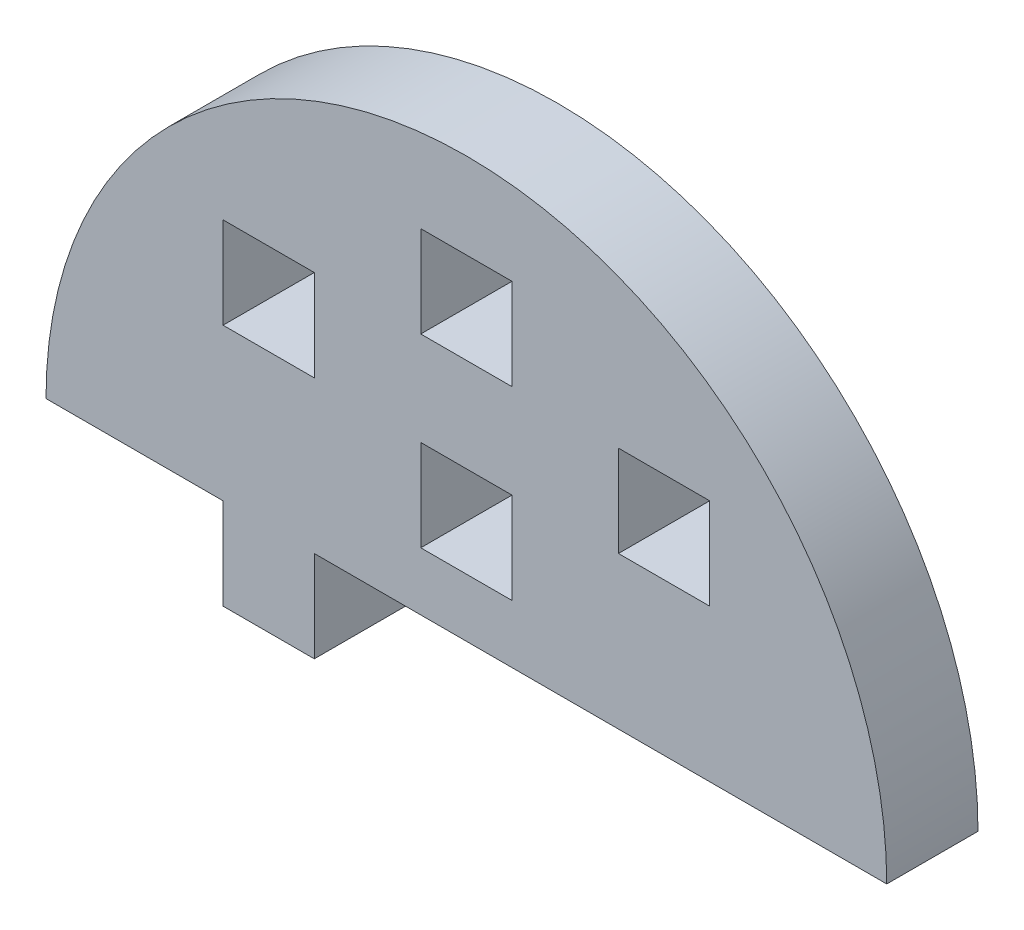
ISO-10303-21;
HEADER;
FILE_DESCRIPTION(('STEP AP214'),'2;1');
FILE_NAME('part.step','',(''),(''),'','','');
FILE_SCHEMA(('AUTOMOTIVE_DESIGN { 1 0 10303 214 1 1 1 1 }'));
ENDSEC;
DATA;
#1=APPLICATION_CONTEXT('core data for automotive mechanical design processes');
#2=APPLICATION_PROTOCOL_DEFINITION('international standard','automotive_design',2000,#1);
#3=PRODUCT_CONTEXT('',#1,'mechanical');
#4=PRODUCT('Part','Part','',(#3));
#5=PRODUCT_RELATED_PRODUCT_CATEGORY('part','',(#4));
#6=PRODUCT_DEFINITION_FORMATION('','',#4);
#7=PRODUCT_DEFINITION_CONTEXT('part definition',#1,'design');
#8=PRODUCT_DEFINITION('design','',#6,#7);
#9=PRODUCT_DEFINITION_SHAPE('','',#8);
#10=(LENGTH_UNIT() NAMED_UNIT(*) SI_UNIT(.MILLI.,.METRE.));
#11=(NAMED_UNIT(*) PLANE_ANGLE_UNIT() SI_UNIT($,.RADIAN.));
#12=(NAMED_UNIT(*) SI_UNIT($,.STERADIAN.) SOLID_ANGLE_UNIT());
#13=UNCERTAINTY_MEASURE_WITH_UNIT(LENGTH_MEASURE(1.E-05),#10,'distance_accuracy_value','');
#14=(GEOMETRIC_REPRESENTATION_CONTEXT(3) GLOBAL_UNCERTAINTY_ASSIGNED_CONTEXT((#13)) GLOBAL_UNIT_ASSIGNED_CONTEXT((#10,
#11,#12)) REPRESENTATION_CONTEXT('',''));
#15=CARTESIAN_POINT('',(0.,0.,0.));
#16=DIRECTION('',(0.,0.,1.));
#17=DIRECTION('',(1.,0.,0.));
#18=AXIS2_PLACEMENT_3D('',#15,#16,#17);
#19=CARTESIAN_POINT('',(3501.84727569733,1193.0171466111,6.));
#20=DIRECTION('',(0.,0.,1.));
#21=DIRECTION('',(1.,0.,0.));
#22=AXIS2_PLACEMENT_3D('',#19,#20,#21);
#23=PLANE('',#22);
#24=DIRECTION('',(0.,1.,0.));
#25=VECTOR('',#24,1.);
#26=CARTESIAN_POINT('',(3511.84727569733,0.,6.));
#27=LINE('',#26,#25);
#28=CARTESIAN_POINT('',(3511.84727569733,1203.0171466111,6.));
#29=VERTEX_POINT('',#28);
#30=CARTESIAN_POINT('',(3511.84727569733,1209.0171466111,6.));
#31=VERTEX_POINT('',#30);
#32=EDGE_CURVE('E321',#29,#31,#27,.T.);
#33=ORIENTED_EDGE('',*,*,#32,.T.);
#34=DIRECTION('',(1.,0.,0.));
#35=VECTOR('',#34,1.);
#36=CARTESIAN_POINT('',(0.,1209.0171466111,6.));
#37=LINE('',#36,#35);
#38=CARTESIAN_POINT('',(3517.84727569733,1209.0171466111,6.));
#39=VERTEX_POINT('',#38);
#40=EDGE_CURVE('E334',#31,#39,#37,.T.);
#41=ORIENTED_EDGE('',*,*,#40,.T.);
#42=DIRECTION('',(0.,-1.,0.));
#43=VECTOR('',#42,1.);
#44=CARTESIAN_POINT('',(3517.84727569733,0.,6.));
#45=LINE('',#44,#43);
#46=CARTESIAN_POINT('',(3517.84727569733,1203.0171466111,6.));
#47=VERTEX_POINT('',#46);
#48=EDGE_CURVE('E175',#39,#47,#45,.T.);
#49=ORIENTED_EDGE('',*,*,#48,.T.);
#50=DIRECTION('',(-1.,0.,0.));
#51=VECTOR('',#50,1.);
#52=CARTESIAN_POINT('',(0.,1203.0171466111,6.));
#53=LINE('',#52,#51);
#54=EDGE_CURVE('E313',#47,#29,#53,.T.);
#55=ORIENTED_EDGE('',*,*,#54,.T.);
#56=EDGE_LOOP('',(#33,#41,#49,#55));
#57=FACE_BOUND('',#56,.T.);
#58=DIRECTION('',(0.,1.,0.));
#59=VECTOR('',#58,1.);
#60=CARTESIAN_POINT('',(3498.84727569733,0.,6.));
#61=LINE('',#60,#59);
#62=CARTESIAN_POINT('',(3498.84727569733,1209.0171466111,6.));
#63=VERTEX_POINT('',#62);
#64=CARTESIAN_POINT('',(3498.84727569733,1215.0171466111,6.));
#65=VERTEX_POINT('',#64);
#66=EDGE_CURVE('E400',#63,#65,#61,.T.);
#67=ORIENTED_EDGE('',*,*,#66,.T.);
#68=DIRECTION('',(1.,0.,0.));
#69=VECTOR('',#68,1.);
#70=CARTESIAN_POINT('',(0.,1215.0171466111,6.));
#71=LINE('',#70,#69);
#72=CARTESIAN_POINT('',(3504.84727569733,1215.0171466111,6.));
#73=VERTEX_POINT('',#72);
#74=EDGE_CURVE('E413',#65,#73,#71,.T.);
#75=ORIENTED_EDGE('',*,*,#74,.T.);
#76=DIRECTION('',(0.,-1.,0.));
#77=VECTOR('',#76,1.);
#78=CARTESIAN_POINT('',(3504.84727569733,0.,6.));
#79=LINE('',#78,#77);
#80=CARTESIAN_POINT('',(3504.84727569733,1209.0171466111,6.));
#81=VERTEX_POINT('',#80);
#82=EDGE_CURVE('E409',#73,#81,#79,.T.);
#83=ORIENTED_EDGE('',*,*,#82,.T.);
#84=DIRECTION('',(-1.,0.,0.));
#85=VECTOR('',#84,1.);
#86=CARTESIAN_POINT('',(0.,1209.0171466111,6.));
#87=LINE('',#86,#85);
#88=EDGE_CURVE('E404',#81,#63,#87,.T.);
#89=ORIENTED_EDGE('',*,*,#88,.T.);
#90=EDGE_LOOP('',(#67,#75,#83,#89));
#91=FACE_BOUND('',#90,.T.);
#92=DIRECTION('',(1.,6.72453869943398E-13,0.));
#93=VECTOR('',#92,1.);
#94=CARTESIAN_POINT('',(3491.84727569733,1193.0171466111,6.));
#95=LINE('',#94,#93);
#96=CARTESIAN_POINT('',(3491.84727569733,1193.0171466111,6.));
#97=VERTEX_POINT('',#96);
#98=CARTESIAN_POINT('',(3529.49013284021,1193.01714661112,6.));
#99=VERTEX_POINT('',#98);
#100=EDGE_CURVE('E487',#97,#99,#95,.T.);
#101=ORIENTED_EDGE('',*,*,#100,.T.);
#102=CARTESIAN_POINT('',(3501.84727569733,1193.0171466111,6.));
#103=DIRECTION('',(0.,0.,1.));
#104=DIRECTION('',(1.,0.,0.));
#105=AXIS2_PLACEMENT_3D('',#102,#103,#104);
#106=CIRCLE('',#105,27.642857142876);
#107=CARTESIAN_POINT('',(3474.20441855446,1193.01714661112,6.));
#108=VERTEX_POINT('',#107);
#109=EDGE_CURVE('E491',#99,#108,#106,.T.);
#110=ORIENTED_EDGE('',*,*,#109,.T.);
#111=DIRECTION('',(1.,-2.17412999668575E-12,0.));
#112=VECTOR('',#111,1.);
#113=CARTESIAN_POINT('',(3474.20441855446,1193.01714661112,6.));
#114=LINE('',#113,#112);
#115=CARTESIAN_POINT('',(3485.84727569733,1193.0171466111,6.));
#116=VERTEX_POINT('',#115);
#117=EDGE_CURVE('E495',#108,#116,#114,.T.);
#118=ORIENTED_EDGE('',*,*,#117,.T.);
#119=DIRECTION('',(0.,1.,0.));
#120=VECTOR('',#119,1.);
#121=CARTESIAN_POINT('',(3485.84727569733,1187.0171466111,6.));
#122=LINE('',#121,#120);
#123=CARTESIAN_POINT('',(3485.84727569733,1187.0171466111,6.));
#124=VERTEX_POINT('',#123);
#125=EDGE_CURVE('E498',#124,#116,#122,.T.);
#126=ORIENTED_EDGE('',*,*,#125,.F.);
#127=DIRECTION('',(-1.,0.,0.));
#128=VECTOR('',#127,1.);
#129=CARTESIAN_POINT('',(3491.84727569733,1187.0171466111,6.));
#130=LINE('',#129,#128);
#131=CARTESIAN_POINT('',(3491.84727569733,1187.0171466111,6.));
#132=VERTEX_POINT('',#131);
#133=EDGE_CURVE('E502',#132,#124,#130,.T.);
#134=ORIENTED_EDGE('',*,*,#133,.F.);
#135=DIRECTION('',(0.,-1.,0.));
#136=VECTOR('',#135,1.);
#137=CARTESIAN_POINT('',(3491.84727569733,1193.0171466111,6.));
#138=LINE('',#137,#136);
#139=EDGE_CURVE('E506',#97,#132,#138,.T.);
#140=ORIENTED_EDGE('',*,*,#139,.F.);
#141=EDGE_LOOP('',(#101,#110,#118,#126,#134,#140));
#142=FACE_BOUND('',#141,.T.);
#143=DIRECTION('',(0.,1.,0.));
#144=VECTOR('',#143,1.);
#145=CARTESIAN_POINT('',(3491.84727569733,0.,6.));
#146=LINE('',#145,#144);
#147=CARTESIAN_POINT('',(3491.84727569733,1203.0171466111,6.));
#148=VERTEX_POINT('',#147);
#149=CARTESIAN_POINT('',(3491.84727569733,1209.0171466111,6.));
#150=VERTEX_POINT('',#149);
#151=EDGE_CURVE('E447',#148,#150,#146,.T.);
#152=ORIENTED_EDGE('',*,*,#151,.F.);
#153=DIRECTION('',(1.,0.,0.));
#154=VECTOR('',#153,1.);
#155=CARTESIAN_POINT('',(0.,1203.0171466111,6.));
#156=LINE('',#155,#154);
#157=CARTESIAN_POINT('',(3485.84727569733,1203.0171466111,6.));
#158=VERTEX_POINT('',#157);
#159=EDGE_CURVE('E444',#158,#148,#156,.T.);
#160=ORIENTED_EDGE('',*,*,#159,.F.);
#161=DIRECTION('',(0.,-1.,0.));
#162=VECTOR('',#161,1.);
#163=CARTESIAN_POINT('',(3485.84727569733,0.,6.));
#164=LINE('',#163,#162);
#165=CARTESIAN_POINT('',(3485.84727569733,1209.0171466111,6.));
#166=VERTEX_POINT('',#165);
#167=EDGE_CURVE('E455',#166,#158,#164,.T.);
#168=ORIENTED_EDGE('',*,*,#167,.F.);
#169=DIRECTION('',(-1.,0.,0.));
#170=VECTOR('',#169,1.);
#171=CARTESIAN_POINT('',(0.,1209.0171466111,6.));
#172=LINE('',#171,#170);
#173=EDGE_CURVE('E451',#150,#166,#172,.T.);
#174=ORIENTED_EDGE('',*,*,#173,.F.);
#175=EDGE_LOOP('',(#152,#160,#168,#174));
#176=FACE_BOUND('',#175,.T.);
#177=DIRECTION('',(0.,-1.,0.));
#178=VECTOR('',#177,1.);
#179=CARTESIAN_POINT('',(3498.84727569733,0.,6.));
#180=LINE('',#179,#178);
#181=CARTESIAN_POINT('',(3498.84727569733,1202.84160544451,6.));
#182=VERTEX_POINT('',#181);
#183=CARTESIAN_POINT('',(3498.84727569733,1196.84160544451,6.));
#184=VERTEX_POINT('',#183);
#185=EDGE_CURVE('E360',#182,#184,#180,.T.);
#186=ORIENTED_EDGE('',*,*,#185,.F.);
#187=DIRECTION('',(-1.,0.,0.));
#188=VECTOR('',#187,1.);
#189=CARTESIAN_POINT('',(0.,1202.84160544451,6.));
#190=LINE('',#189,#188);
#191=CARTESIAN_POINT('',(3504.84727569733,1202.84160544451,6.));
#192=VERTEX_POINT('',#191);
#193=EDGE_CURVE('E357',#192,#182,#190,.T.);
#194=ORIENTED_EDGE('',*,*,#193,.F.);
#195=DIRECTION('',(0.,1.,0.));
#196=VECTOR('',#195,1.);
#197=CARTESIAN_POINT('',(3504.84727569733,0.,6.));
#198=LINE('',#197,#196);
#199=CARTESIAN_POINT('',(3504.84727569733,1196.84160544451,6.));
#200=VERTEX_POINT('',#199);
#201=EDGE_CURVE('E368',#200,#192,#198,.T.);
#202=ORIENTED_EDGE('',*,*,#201,.F.);
#203=DIRECTION('',(1.,0.,0.));
#204=VECTOR('',#203,1.);
#205=CARTESIAN_POINT('',(0.,1196.84160544451,6.));
#206=LINE('',#205,#204);
#207=EDGE_CURVE('E364',#184,#200,#206,.T.);
#208=ORIENTED_EDGE('',*,*,#207,.F.);
#209=EDGE_LOOP('',(#186,#194,#202,#208));
#210=FACE_BOUND('',#209,.T.);
#211=ADVANCED_FACE('F159',(#57,#91,#142,#176,#210),#23,.T.);
#212=CARTESIAN_POINT('',(3501.84727569733,1193.0171466111,0.));
#213=DIRECTION('',(0.,0.,1.));
#214=DIRECTION('',(1.,0.,0.));
#215=AXIS2_PLACEMENT_3D('',#212,#213,#214);
#216=PLANE('',#215);
#217=DIRECTION('',(1.,0.,0.));
#218=VECTOR('',#217,1.);
#219=CARTESIAN_POINT('',(0.,1209.0171466111,0.));
#220=LINE('',#219,#218);
#221=CARTESIAN_POINT('',(3511.84727569733,1209.0171466111,0.));
#222=VERTEX_POINT('',#221);
#223=CARTESIAN_POINT('',(3517.84727569733,1209.0171466111,0.));
#224=VERTEX_POINT('',#223);
#225=EDGE_CURVE('E328',#222,#224,#220,.T.);
#226=ORIENTED_EDGE('',*,*,#225,.F.);
#227=DIRECTION('',(0.,1.,0.));
#228=VECTOR('',#227,1.);
#229=CARTESIAN_POINT('',(3511.84727569733,0.,0.));
#230=LINE('',#229,#228);
#231=CARTESIAN_POINT('',(3511.84727569733,1203.0171466111,0.));
#232=VERTEX_POINT('',#231);
#233=EDGE_CURVE('E183',#232,#222,#230,.T.);
#234=ORIENTED_EDGE('',*,*,#233,.F.);
#235=DIRECTION('',(-1.,0.,0.));
#236=VECTOR('',#235,1.);
#237=CARTESIAN_POINT('',(0.,1203.0171466111,0.));
#238=LINE('',#237,#236);
#239=CARTESIAN_POINT('',(3517.84727569733,1203.0171466111,0.));
#240=VERTEX_POINT('',#239);
#241=EDGE_CURVE('E315',#240,#232,#238,.T.);
#242=ORIENTED_EDGE('',*,*,#241,.F.);
#243=DIRECTION('',(0.,-1.,0.));
#244=VECTOR('',#243,1.);
#245=CARTESIAN_POINT('',(3517.84727569733,0.,0.));
#246=LINE('',#245,#244);
#247=EDGE_CURVE('E343',#224,#240,#246,.T.);
#248=ORIENTED_EDGE('',*,*,#247,.F.);
#249=EDGE_LOOP('',(#226,#234,#242,#248));
#250=FACE_BOUND('',#249,.T.);
#251=DIRECTION('',(1.,0.,0.));
#252=VECTOR('',#251,1.);
#253=CARTESIAN_POINT('',(0.,1203.0171466111,0.));
#254=LINE('',#253,#252);
#255=CARTESIAN_POINT('',(3485.84727569733,1203.0171466111,0.));
#256=VERTEX_POINT('',#255);
#257=CARTESIAN_POINT('',(3491.84727569733,1203.0171466111,0.));
#258=VERTEX_POINT('',#257);
#259=EDGE_CURVE('E443',#256,#258,#254,.T.);
#260=ORIENTED_EDGE('',*,*,#259,.T.);
#261=DIRECTION('',(0.,1.,0.));
#262=VECTOR('',#261,1.);
#263=CARTESIAN_POINT('',(3491.84727569733,0.,0.));
#264=LINE('',#263,#262);
#265=CARTESIAN_POINT('',(3491.84727569733,1209.0171466111,0.));
#266=VERTEX_POINT('',#265);
#267=EDGE_CURVE('E462',#258,#266,#264,.T.);
#268=ORIENTED_EDGE('',*,*,#267,.T.);
#269=DIRECTION('',(-1.,0.,0.));
#270=VECTOR('',#269,1.);
#271=CARTESIAN_POINT('',(0.,1209.0171466111,0.));
#272=LINE('',#271,#270);
#273=CARTESIAN_POINT('',(3485.84727569733,1209.0171466111,0.));
#274=VERTEX_POINT('',#273);
#275=EDGE_CURVE('E466',#266,#274,#272,.T.);
#276=ORIENTED_EDGE('',*,*,#275,.T.);
#277=DIRECTION('',(0.,-1.,0.));
#278=VECTOR('',#277,1.);
#279=CARTESIAN_POINT('',(3485.84727569733,0.,0.));
#280=LINE('',#279,#278);
#281=EDGE_CURVE('E448',#274,#256,#280,.T.);
#282=ORIENTED_EDGE('',*,*,#281,.T.);
#283=EDGE_LOOP('',(#260,#268,#276,#282));
#284=FACE_BOUND('',#283,.T.);
#285=DIRECTION('',(1.,6.72453869943398E-13,0.));
#286=VECTOR('',#285,1.);
#287=CARTESIAN_POINT('',(3491.84727569733,1193.0171466111,0.));
#288=LINE('',#287,#286);
#289=CARTESIAN_POINT('',(3491.84727569733,1193.0171466111,0.));
#290=VERTEX_POINT('',#289);
#291=CARTESIAN_POINT('',(3529.49013284021,1193.01714661112,0.));
#292=VERTEX_POINT('',#291);
#293=EDGE_CURVE('E486',#290,#292,#288,.T.);
#294=ORIENTED_EDGE('',*,*,#293,.F.);
#295=DIRECTION('',(0.,-1.,0.));
#296=VECTOR('',#295,1.);
#297=CARTESIAN_POINT('',(3491.84727569733,1193.0171466111,0.));
#298=LINE('',#297,#296);
#299=CARTESIAN_POINT('',(3491.84727569733,1187.0171466111,0.));
#300=VERTEX_POINT('',#299);
#301=EDGE_CURVE('E492',#290,#300,#298,.T.);
#302=ORIENTED_EDGE('',*,*,#301,.T.);
#303=DIRECTION('',(-1.,0.,0.));
#304=VECTOR('',#303,1.);
#305=CARTESIAN_POINT('',(3491.84727569733,1187.0171466111,0.));
#306=LINE('',#305,#304);
#307=CARTESIAN_POINT('',(3485.84727569733,1187.0171466111,0.));
#308=VERTEX_POINT('',#307);
#309=EDGE_CURVE('E525',#300,#308,#306,.T.);
#310=ORIENTED_EDGE('',*,*,#309,.T.);
#311=DIRECTION('',(0.,1.,0.));
#312=VECTOR('',#311,1.);
#313=CARTESIAN_POINT('',(3485.84727569733,1187.0171466111,0.));
#314=LINE('',#313,#312);
#315=CARTESIAN_POINT('',(3485.84727569733,1193.0171466111,0.));
#316=VERTEX_POINT('',#315);
#317=EDGE_CURVE('E521',#308,#316,#314,.T.);
#318=ORIENTED_EDGE('',*,*,#317,.T.);
#319=DIRECTION('',(1.,-2.17412999668575E-12,0.));
#320=VECTOR('',#319,1.);
#321=CARTESIAN_POINT('',(3474.20441855446,1193.01714661112,0.));
#322=LINE('',#321,#320);
#323=CARTESIAN_POINT('',(3474.20441855446,1193.01714661112,0.));
#324=VERTEX_POINT('',#323);
#325=EDGE_CURVE('E517',#324,#316,#322,.T.);
#326=ORIENTED_EDGE('',*,*,#325,.F.);
#327=CARTESIAN_POINT('',(3501.84727569733,1193.0171466111,0.));
#328=DIRECTION('',(0.,0.,1.));
#329=DIRECTION('',(1.,0.,0.));
#330=AXIS2_PLACEMENT_3D('',#327,#328,#329);
#331=CIRCLE('',#330,27.642857142876);
#332=EDGE_CURVE('E514',#292,#324,#331,.T.);
#333=ORIENTED_EDGE('',*,*,#332,.F.);
#334=EDGE_LOOP('',(#294,#302,#310,#318,#326,#333));
#335=FACE_BOUND('',#334,.T.);
#336=DIRECTION('',(1.,0.,0.));
#337=VECTOR('',#336,1.);
#338=CARTESIAN_POINT('',(0.,1215.0171466111,0.));
#339=LINE('',#338,#337);
#340=CARTESIAN_POINT('',(3498.84727569733,1215.0171466111,0.));
#341=VERTEX_POINT('',#340);
#342=CARTESIAN_POINT('',(3504.84727569733,1215.0171466111,0.));
#343=VERTEX_POINT('',#342);
#344=EDGE_CURVE('E405',#341,#343,#339,.T.);
#345=ORIENTED_EDGE('',*,*,#344,.F.);
#346=DIRECTION('',(0.,1.,0.));
#347=VECTOR('',#346,1.);
#348=CARTESIAN_POINT('',(3498.84727569733,0.,0.));
#349=LINE('',#348,#347);
#350=CARTESIAN_POINT('',(3498.84727569733,1209.0171466111,0.));
#351=VERTEX_POINT('',#350);
#352=EDGE_CURVE('E399',#351,#341,#349,.T.);
#353=ORIENTED_EDGE('',*,*,#352,.F.);
#354=DIRECTION('',(-1.,0.,0.));
#355=VECTOR('',#354,1.);
#356=CARTESIAN_POINT('',(0.,1209.0171466111,0.));
#357=LINE('',#356,#355);
#358=CARTESIAN_POINT('',(3504.84727569733,1209.0171466111,0.));
#359=VERTEX_POINT('',#358);
#360=EDGE_CURVE('E420',#359,#351,#357,.T.);
#361=ORIENTED_EDGE('',*,*,#360,.F.);
#362=DIRECTION('',(0.,-1.,0.));
#363=VECTOR('',#362,1.);
#364=CARTESIAN_POINT('',(3504.84727569733,0.,0.));
#365=LINE('',#364,#363);
#366=EDGE_CURVE('E424',#343,#359,#365,.T.);
#367=ORIENTED_EDGE('',*,*,#366,.F.);
#368=EDGE_LOOP('',(#345,#353,#361,#367));
#369=FACE_BOUND('',#368,.T.);
#370=DIRECTION('',(-1.,0.,0.));
#371=VECTOR('',#370,1.);
#372=CARTESIAN_POINT('',(0.,1202.84160544451,0.));
#373=LINE('',#372,#371);
#374=CARTESIAN_POINT('',(3504.84727569733,1202.84160544451,0.));
#375=VERTEX_POINT('',#374);
#376=CARTESIAN_POINT('',(3498.84727569733,1202.84160544451,0.));
#377=VERTEX_POINT('',#376);
#378=EDGE_CURVE('E317',#375,#377,#373,.T.);
#379=ORIENTED_EDGE('',*,*,#378,.T.);
#380=DIRECTION('',(0.,-1.,0.));
#381=VECTOR('',#380,1.);
#382=CARTESIAN_POINT('',(3498.84727569733,0.,0.));
#383=LINE('',#382,#381);
#384=CARTESIAN_POINT('',(3498.84727569733,1196.84160544451,0.));
#385=VERTEX_POINT('',#384);
#386=EDGE_CURVE('E375',#377,#385,#383,.T.);
#387=ORIENTED_EDGE('',*,*,#386,.T.);
#388=DIRECTION('',(1.,0.,0.));
#389=VECTOR('',#388,1.);
#390=CARTESIAN_POINT('',(0.,1196.84160544451,0.));
#391=LINE('',#390,#389);
#392=CARTESIAN_POINT('',(3504.84727569733,1196.84160544451,0.));
#393=VERTEX_POINT('',#392);
#394=EDGE_CURVE('E379',#385,#393,#391,.T.);
#395=ORIENTED_EDGE('',*,*,#394,.T.);
#396=DIRECTION('',(0.,1.,0.));
#397=VECTOR('',#396,1.);
#398=CARTESIAN_POINT('',(3504.84727569733,0.,0.));
#399=LINE('',#398,#397);
#400=EDGE_CURVE('E361',#393,#375,#399,.T.);
#401=ORIENTED_EDGE('',*,*,#400,.T.);
#402=EDGE_LOOP('',(#379,#387,#395,#401));
#403=FACE_BOUND('',#402,.T.);
#404=ADVANCED_FACE('F553',(#250,#284,#335,#369,#403),#216,.F.);
#405=CARTESIAN_POINT('',(3491.84727569733,1193.0171466111,6.));
#406=DIRECTION('',(-6.72453869943398E-13,1.,0.));
#407=DIRECTION('',(-1.,-6.72453869943398E-13,0.));
#408=AXIS2_PLACEMENT_3D('',#405,#406,#407);
#409=PLANE('',#408);
#410=ORIENTED_EDGE('',*,*,#293,.T.);
#411=DIRECTION('',(0.,0.,-1.));
#412=VECTOR('',#411,1.);
#413=CARTESIAN_POINT('',(3529.49013284021,1193.01714661112,6.));
#414=LINE('',#413,#412);
#415=EDGE_CURVE('E12',#99,#292,#414,.T.);
#416=ORIENTED_EDGE('',*,*,#415,.F.);
#417=ORIENTED_EDGE('',*,*,#100,.F.);
#418=DIRECTION('',(0.,0.,-1.));
#419=VECTOR('',#418,1.);
#420=CARTESIAN_POINT('',(3491.84727569733,1193.0171466111,6.));
#421=LINE('',#420,#419);
#422=EDGE_CURVE('E510',#97,#290,#421,.T.);
#423=ORIENTED_EDGE('',*,*,#422,.T.);
#424=EDGE_LOOP('',(#410,#416,#417,#423));
#425=FACE_BOUND('',#424,.T.);
#426=ADVANCED_FACE('F161',(#425),#409,.F.);
#427=CARTESIAN_POINT('',(3501.84727569733,1193.0171466111,6.));
#428=DIRECTION('',(0.,0.,-1.));
#429=DIRECTION('',(-1.,0.,0.));
#430=AXIS2_PLACEMENT_3D('',#427,#428,#429);
#431=CYLINDRICAL_SURFACE('',#430,27.642857142876);
#432=ORIENTED_EDGE('',*,*,#332,.T.);
#433=DIRECTION('',(0.,0.,-1.));
#434=VECTOR('',#433,1.);
#435=CARTESIAN_POINT('',(3474.20441855446,1193.01714661112,6.));
#436=LINE('',#435,#434);
#437=EDGE_CURVE('E168',#108,#324,#436,.T.);
#438=ORIENTED_EDGE('',*,*,#437,.F.);
#439=ORIENTED_EDGE('',*,*,#109,.F.);
#440=ORIENTED_EDGE('',*,*,#415,.T.);
#441=EDGE_LOOP('',(#432,#438,#439,#440));
#442=FACE_BOUND('',#441,.T.);
#443=ADVANCED_FACE('F572',(#442),#431,.T.);
#444=CARTESIAN_POINT('',(3474.20441855446,1193.01714661112,6.));
#445=DIRECTION('',(2.17412999668575E-12,1.,0.));
#446=DIRECTION('',(-1.,2.17412999668575E-12,0.));
#447=AXIS2_PLACEMENT_3D('',#444,#445,#446);
#448=PLANE('',#447);
#449=ORIENTED_EDGE('',*,*,#325,.T.);
#450=DIRECTION('',(0.,0.,-1.));
#451=VECTOR('',#450,1.);
#452=CARTESIAN_POINT('',(3485.84727569733,1193.0171466111,6.));
#453=LINE('',#452,#451);
#454=EDGE_CURVE('E540',#116,#316,#453,.T.);
#455=ORIENTED_EDGE('',*,*,#454,.F.);
#456=ORIENTED_EDGE('',*,*,#117,.F.);
#457=ORIENTED_EDGE('',*,*,#437,.T.);
#458=EDGE_LOOP('',(#449,#455,#456,#457));
#459=FACE_BOUND('',#458,.T.);
#460=ADVANCED_FACE('F548',(#459),#448,.F.);
#461=CARTESIAN_POINT('',(3485.84727569733,1187.0171466111,6.));
#462=DIRECTION('',(-1.,0.,0.));
#463=DIRECTION('',(0.,0.,1.));
#464=AXIS2_PLACEMENT_3D('',#461,#462,#463);
#465=PLANE('',#464);
#466=ORIENTED_EDGE('',*,*,#317,.F.);
#467=DIRECTION('',(0.,0.,-1.));
#468=VECTOR('',#467,1.);
#469=CARTESIAN_POINT('',(3485.84727569733,1187.0171466111,6.));
#470=LINE('',#469,#468);
#471=EDGE_CURVE('E537',#124,#308,#470,.T.);
#472=ORIENTED_EDGE('',*,*,#471,.F.);
#473=ORIENTED_EDGE('',*,*,#125,.T.);
#474=ORIENTED_EDGE('',*,*,#454,.T.);
#475=EDGE_LOOP('',(#466,#472,#473,#474));
#476=FACE_BOUND('',#475,.T.);
#477=ADVANCED_FACE('F558',(#476),#465,.T.);
#478=CARTESIAN_POINT('',(3491.84727569733,1187.0171466111,6.));
#479=DIRECTION('',(0.,-1.,0.));
#480=DIRECTION('',(0.,0.,-1.));
#481=AXIS2_PLACEMENT_3D('',#478,#479,#480);
#482=PLANE('',#481);
#483=ORIENTED_EDGE('',*,*,#309,.F.);
#484=DIRECTION('',(0.,0.,-1.));
#485=VECTOR('',#484,1.);
#486=CARTESIAN_POINT('',(3491.84727569733,1187.0171466111,6.));
#487=LINE('',#486,#485);
#488=EDGE_CURVE('E534',#132,#300,#487,.T.);
#489=ORIENTED_EDGE('',*,*,#488,.F.);
#490=ORIENTED_EDGE('',*,*,#133,.T.);
#491=ORIENTED_EDGE('',*,*,#471,.T.);
#492=EDGE_LOOP('',(#483,#489,#490,#491));
#493=FACE_BOUND('',#492,.T.);
#494=ADVANCED_FACE('F565',(#493),#482,.T.);
#495=CARTESIAN_POINT('',(3491.84727569733,1193.0171466111,6.));
#496=DIRECTION('',(1.,0.,0.));
#497=DIRECTION('',(0.,0.,-1.));
#498=AXIS2_PLACEMENT_3D('',#495,#496,#497);
#499=PLANE('',#498);
#500=ORIENTED_EDGE('',*,*,#301,.F.);
#501=ORIENTED_EDGE('',*,*,#422,.F.);
#502=ORIENTED_EDGE('',*,*,#139,.T.);
#503=ORIENTED_EDGE('',*,*,#488,.T.);
#504=EDGE_LOOP('',(#500,#501,#502,#503));
#505=FACE_BOUND('',#504,.T.);
#506=ADVANCED_FACE('F568',(#505),#499,.T.);
#507=CARTESIAN_POINT('',(0.,1203.0171466111,6.));
#508=DIRECTION('',(0.,1.,0.));
#509=DIRECTION('',(0.,0.,1.));
#510=AXIS2_PLACEMENT_3D('',#507,#508,#509);
#511=PLANE('',#510);
#512=ORIENTED_EDGE('',*,*,#259,.F.);
#513=DIRECTION('',(0.,0.,-1.));
#514=VECTOR('',#513,1.);
#515=CARTESIAN_POINT('',(3485.84727569733,1203.0171466111,6.));
#516=LINE('',#515,#514);
#517=EDGE_CURVE('E458',#158,#256,#516,.T.);
#518=ORIENTED_EDGE('',*,*,#517,.F.);
#519=ORIENTED_EDGE('',*,*,#159,.T.);
#520=DIRECTION('',(0.,0.,-1.));
#521=VECTOR('',#520,1.);
#522=CARTESIAN_POINT('',(3491.84727569733,1203.0171466111,6.));
#523=LINE('',#522,#521);
#524=EDGE_CURVE('E482',#148,#258,#523,.T.);
#525=ORIENTED_EDGE('',*,*,#524,.T.);
#526=EDGE_LOOP('',(#512,#518,#519,#525));
#527=FACE_BOUND('',#526,.T.);
#528=ADVANCED_FACE('F587',(#527),#511,.T.);
#529=CARTESIAN_POINT('',(3491.84727569733,0.,6.));
#530=DIRECTION('',(-1.,0.,0.));
#531=DIRECTION('',(0.,0.,1.));
#532=AXIS2_PLACEMENT_3D('',#529,#530,#531);
#533=PLANE('',#532);
#534=ORIENTED_EDGE('',*,*,#267,.F.);
#535=ORIENTED_EDGE('',*,*,#524,.F.);
#536=ORIENTED_EDGE('',*,*,#151,.T.);
#537=DIRECTION('',(0.,0.,-1.));
#538=VECTOR('',#537,1.);
#539=CARTESIAN_POINT('',(3491.84727569733,1209.0171466111,6.));
#540=LINE('',#539,#538);
#541=EDGE_CURVE('E479',#150,#266,#540,.T.);
#542=ORIENTED_EDGE('',*,*,#541,.T.);
#543=EDGE_LOOP('',(#534,#535,#536,#542));
#544=FACE_BOUND('',#543,.T.);
#545=ADVANCED_FACE('F613',(#544),#533,.T.);
#546=CARTESIAN_POINT('',(0.,1209.0171466111,6.));
#547=DIRECTION('',(0.,-1.,0.));
#548=DIRECTION('',(0.,0.,-1.));
#549=AXIS2_PLACEMENT_3D('',#546,#547,#548);
#550=PLANE('',#549);
#551=ORIENTED_EDGE('',*,*,#275,.F.);
#552=ORIENTED_EDGE('',*,*,#541,.F.);
#553=ORIENTED_EDGE('',*,*,#173,.T.);
#554=DIRECTION('',(0.,0.,-1.));
#555=VECTOR('',#554,1.);
#556=CARTESIAN_POINT('',(3485.84727569733,1209.0171466111,6.));
#557=LINE('',#556,#555);
#558=EDGE_CURVE('E476',#166,#274,#557,.T.);
#559=ORIENTED_EDGE('',*,*,#558,.T.);
#560=EDGE_LOOP('',(#551,#552,#553,#559));
#561=FACE_BOUND('',#560,.T.);
#562=ADVANCED_FACE('F620',(#561),#550,.T.);
#563=CARTESIAN_POINT('',(3485.84727569733,0.,6.));
#564=DIRECTION('',(1.,0.,0.));
#565=DIRECTION('',(0.,0.,-1.));
#566=AXIS2_PLACEMENT_3D('',#563,#564,#565);
#567=PLANE('',#566);
#568=ORIENTED_EDGE('',*,*,#281,.F.);
#569=ORIENTED_EDGE('',*,*,#558,.F.);
#570=ORIENTED_EDGE('',*,*,#167,.T.);
#571=ORIENTED_EDGE('',*,*,#517,.T.);
#572=EDGE_LOOP('',(#568,#569,#570,#571));
#573=FACE_BOUND('',#572,.T.);
#574=ADVANCED_FACE('F627',(#573),#567,.T.);
#575=CARTESIAN_POINT('',(3498.84727569733,0.,6.));
#576=DIRECTION('',(-1.,0.,0.));
#577=DIRECTION('',(0.,0.,1.));
#578=AXIS2_PLACEMENT_3D('',#575,#576,#577);
#579=PLANE('',#578);
#580=ORIENTED_EDGE('',*,*,#352,.T.);
#581=DIRECTION('',(0.,0.,-1.));
#582=VECTOR('',#581,1.);
#583=CARTESIAN_POINT('',(3498.84727569733,1215.0171466111,6.));
#584=LINE('',#583,#582);
#585=EDGE_CURVE('E417',#65,#341,#584,.T.);
#586=ORIENTED_EDGE('',*,*,#585,.F.);
#587=ORIENTED_EDGE('',*,*,#66,.F.);
#588=DIRECTION('',(0.,0.,-1.));
#589=VECTOR('',#588,1.);
#590=CARTESIAN_POINT('',(3498.84727569733,1209.0171466111,6.));
#591=LINE('',#590,#589);
#592=EDGE_CURVE('E440',#63,#351,#591,.T.);
#593=ORIENTED_EDGE('',*,*,#592,.T.);
#594=EDGE_LOOP('',(#580,#586,#587,#593));
#595=FACE_BOUND('',#594,.T.);
#596=ADVANCED_FACE('F635',(#595),#579,.F.);
#597=CARTESIAN_POINT('',(0.,1209.0171466111,6.));
#598=DIRECTION('',(0.,-1.,0.));
#599=DIRECTION('',(0.,0.,-1.));
#600=AXIS2_PLACEMENT_3D('',#597,#598,#599);
#601=PLANE('',#600);
#602=ORIENTED_EDGE('',*,*,#360,.T.);
#603=ORIENTED_EDGE('',*,*,#592,.F.);
#604=ORIENTED_EDGE('',*,*,#88,.F.);
#605=DIRECTION('',(0.,0.,-1.));
#606=VECTOR('',#605,1.);
#607=CARTESIAN_POINT('',(3504.84727569733,1209.0171466111,6.));
#608=LINE('',#607,#606);
#609=EDGE_CURVE('E437',#81,#359,#608,.T.);
#610=ORIENTED_EDGE('',*,*,#609,.T.);
#611=EDGE_LOOP('',(#602,#603,#604,#610));
#612=FACE_BOUND('',#611,.T.);
#613=ADVANCED_FACE('F643',(#612),#601,.F.);
#614=CARTESIAN_POINT('',(3504.84727569733,0.,6.));
#615=DIRECTION('',(1.,0.,0.));
#616=DIRECTION('',(0.,0.,-1.));
#617=AXIS2_PLACEMENT_3D('',#614,#615,#616);
#618=PLANE('',#617);
#619=ORIENTED_EDGE('',*,*,#366,.T.);
#620=ORIENTED_EDGE('',*,*,#609,.F.);
#621=ORIENTED_EDGE('',*,*,#82,.F.);
#622=DIRECTION('',(0.,0.,-1.));
#623=VECTOR('',#622,1.);
#624=CARTESIAN_POINT('',(3504.84727569733,1215.0171466111,6.));
#625=LINE('',#624,#623);
#626=EDGE_CURVE('E434',#73,#343,#625,.T.);
#627=ORIENTED_EDGE('',*,*,#626,.T.);
#628=EDGE_LOOP('',(#619,#620,#621,#627));
#629=FACE_BOUND('',#628,.T.);
#630=ADVANCED_FACE('F651',(#629),#618,.F.);
#631=CARTESIAN_POINT('',(0.,1215.0171466111,6.));
#632=DIRECTION('',(0.,1.,0.));
#633=DIRECTION('',(0.,0.,1.));
#634=AXIS2_PLACEMENT_3D('',#631,#632,#633);
#635=PLANE('',#634);
#636=ORIENTED_EDGE('',*,*,#344,.T.);
#637=ORIENTED_EDGE('',*,*,#626,.F.);
#638=ORIENTED_EDGE('',*,*,#74,.F.);
#639=ORIENTED_EDGE('',*,*,#585,.T.);
#640=EDGE_LOOP('',(#636,#637,#638,#639));
#641=FACE_BOUND('',#640,.T.);
#642=ADVANCED_FACE('F659',(#641),#635,.F.);
#643=CARTESIAN_POINT('',(0.,1202.84160544451,6.));
#644=DIRECTION('',(0.,-1.,0.));
#645=DIRECTION('',(0.,0.,-1.));
#646=AXIS2_PLACEMENT_3D('',#643,#644,#645);
#647=PLANE('',#646);
#648=ORIENTED_EDGE('',*,*,#378,.F.);
#649=DIRECTION('',(0.,0.,-1.));
#650=VECTOR('',#649,1.);
#651=CARTESIAN_POINT('',(3504.84727569733,1202.84160544451,6.));
#652=LINE('',#651,#650);
#653=EDGE_CURVE('E371',#192,#375,#652,.T.);
#654=ORIENTED_EDGE('',*,*,#653,.F.);
#655=ORIENTED_EDGE('',*,*,#193,.T.);
#656=DIRECTION('',(0.,0.,-1.));
#657=VECTOR('',#656,1.);
#658=CARTESIAN_POINT('',(3498.84727569733,1202.84160544451,6.));
#659=LINE('',#658,#657);
#660=EDGE_CURVE('E395',#182,#377,#659,.T.);
#661=ORIENTED_EDGE('',*,*,#660,.T.);
#662=EDGE_LOOP('',(#648,#654,#655,#661));
#663=FACE_BOUND('',#662,.T.);
#664=ADVANCED_FACE('F667',(#663),#647,.T.);
#665=CARTESIAN_POINT('',(3498.84727569733,0.,6.));
#666=DIRECTION('',(1.,0.,0.));
#667=DIRECTION('',(0.,0.,-1.));
#668=AXIS2_PLACEMENT_3D('',#665,#666,#667);
#669=PLANE('',#668);
#670=ORIENTED_EDGE('',*,*,#386,.F.);
#671=ORIENTED_EDGE('',*,*,#660,.F.);
#672=ORIENTED_EDGE('',*,*,#185,.T.);
#673=DIRECTION('',(0.,0.,-1.));
#674=VECTOR('',#673,1.);
#675=CARTESIAN_POINT('',(3498.84727569733,1196.84160544451,6.));
#676=LINE('',#675,#674);
#677=EDGE_CURVE('E392',#184,#385,#676,.T.);
#678=ORIENTED_EDGE('',*,*,#677,.T.);
#679=EDGE_LOOP('',(#670,#671,#672,#678));
#680=FACE_BOUND('',#679,.T.);
#681=ADVANCED_FACE('F675',(#680),#669,.T.);
#682=CARTESIAN_POINT('',(0.,1196.84160544451,6.));
#683=DIRECTION('',(0.,1.,0.));
#684=DIRECTION('',(0.,0.,1.));
#685=AXIS2_PLACEMENT_3D('',#682,#683,#684);
#686=PLANE('',#685);
#687=ORIENTED_EDGE('',*,*,#394,.F.);
#688=ORIENTED_EDGE('',*,*,#677,.F.);
#689=ORIENTED_EDGE('',*,*,#207,.T.);
#690=DIRECTION('',(0.,0.,-1.));
#691=VECTOR('',#690,1.);
#692=CARTESIAN_POINT('',(3504.84727569733,1196.84160544451,6.));
#693=LINE('',#692,#691);
#694=EDGE_CURVE('E389',#200,#393,#693,.T.);
#695=ORIENTED_EDGE('',*,*,#694,.T.);
#696=EDGE_LOOP('',(#687,#688,#689,#695));
#697=FACE_BOUND('',#696,.T.);
#698=ADVANCED_FACE('F683',(#697),#686,.T.);
#699=CARTESIAN_POINT('',(3504.84727569733,0.,6.));
#700=DIRECTION('',(-1.,0.,0.));
#701=DIRECTION('',(0.,0.,1.));
#702=AXIS2_PLACEMENT_3D('',#699,#700,#701);
#703=PLANE('',#702);
#704=ORIENTED_EDGE('',*,*,#400,.F.);
#705=ORIENTED_EDGE('',*,*,#694,.F.);
#706=ORIENTED_EDGE('',*,*,#201,.T.);
#707=ORIENTED_EDGE('',*,*,#653,.T.);
#708=EDGE_LOOP('',(#704,#705,#706,#707));
#709=FACE_BOUND('',#708,.T.);
#710=ADVANCED_FACE('F691',(#709),#703,.T.);
#711=CARTESIAN_POINT('',(3511.84727569733,0.,6.));
#712=DIRECTION('',(-1.,0.,0.));
#713=DIRECTION('',(0.,0.,1.));
#714=AXIS2_PLACEMENT_3D('',#711,#712,#713);
#715=PLANE('',#714);
#716=ORIENTED_EDGE('',*,*,#233,.T.);
#717=DIRECTION('',(0.,0.,-1.));
#718=VECTOR('',#717,1.);
#719=CARTESIAN_POINT('',(3511.84727569733,1209.0171466111,6.));
#720=LINE('',#719,#718);
#721=EDGE_CURVE('E323',#31,#222,#720,.T.);
#722=ORIENTED_EDGE('',*,*,#721,.F.);
#723=ORIENTED_EDGE('',*,*,#32,.F.);
#724=DIRECTION('',(0.,0.,-1.));
#725=VECTOR('',#724,1.);
#726=CARTESIAN_POINT('',(3511.84727569733,1203.0171466111,6.));
#727=LINE('',#726,#725);
#728=EDGE_CURVE('E309',#29,#232,#727,.T.);
#729=ORIENTED_EDGE('',*,*,#728,.T.);
#730=EDGE_LOOP('',(#716,#722,#723,#729));
#731=FACE_BOUND('',#730,.T.);
#732=ADVANCED_FACE('F322',(#731),#715,.F.);
#733=CARTESIAN_POINT('',(0.,1203.0171466111,6.));
#734=DIRECTION('',(0.,-1.,0.));
#735=DIRECTION('',(0.,0.,-1.));
#736=AXIS2_PLACEMENT_3D('',#733,#734,#735);
#737=PLANE('',#736);
#738=ORIENTED_EDGE('',*,*,#241,.T.);
#739=ORIENTED_EDGE('',*,*,#728,.F.);
#740=ORIENTED_EDGE('',*,*,#54,.F.);
#741=DIRECTION('',(0.,0.,-1.));
#742=VECTOR('',#741,1.);
#743=CARTESIAN_POINT('',(3517.84727569733,1203.0171466111,6.));
#744=LINE('',#743,#742);
#745=EDGE_CURVE('E318',#47,#240,#744,.T.);
#746=ORIENTED_EDGE('',*,*,#745,.T.);
#747=EDGE_LOOP('',(#738,#739,#740,#746));
#748=FACE_BOUND('',#747,.T.);
#749=ADVANCED_FACE('F311',(#748),#737,.F.);
#750=CARTESIAN_POINT('',(3517.84727569733,0.,6.));
#751=DIRECTION('',(1.,0.,0.));
#752=DIRECTION('',(0.,0.,-1.));
#753=AXIS2_PLACEMENT_3D('',#750,#751,#752);
#754=PLANE('',#753);
#755=ORIENTED_EDGE('',*,*,#247,.T.);
#756=ORIENTED_EDGE('',*,*,#745,.F.);
#757=ORIENTED_EDGE('',*,*,#48,.F.);
#758=DIRECTION('',(0.,0.,-1.));
#759=VECTOR('',#758,1.);
#760=CARTESIAN_POINT('',(3517.84727569733,1209.0171466111,6.));
#761=LINE('',#760,#759);
#762=EDGE_CURVE('E352',#39,#224,#761,.T.);
#763=ORIENTED_EDGE('',*,*,#762,.T.);
#764=EDGE_LOOP('',(#755,#756,#757,#763));
#765=FACE_BOUND('',#764,.T.);
#766=ADVANCED_FACE('F712',(#765),#754,.F.);
#767=CARTESIAN_POINT('',(0.,1209.0171466111,6.));
#768=DIRECTION('',(0.,1.,0.));
#769=DIRECTION('',(0.,0.,1.));
#770=AXIS2_PLACEMENT_3D('',#767,#768,#769);
#771=PLANE('',#770);
#772=ORIENTED_EDGE('',*,*,#225,.T.);
#773=ORIENTED_EDGE('',*,*,#762,.F.);
#774=ORIENTED_EDGE('',*,*,#40,.F.);
#775=ORIENTED_EDGE('',*,*,#721,.T.);
#776=EDGE_LOOP('',(#772,#773,#774,#775));
#777=FACE_BOUND('',#776,.T.);
#778=ADVANCED_FACE('F719',(#777),#771,.F.);
#779=CLOSED_SHELL('',(#211,#404,#426,#443,#460,#477,#494,#506,#528,#545,#562,#574,#596,#613,
#630,#642,#664,#681,#698,#710,#732,#749,#766,#778));
#780=MANIFOLD_SOLID_BREP('B2',#779);
#781=ADVANCED_BREP_SHAPE_REPRESENTATION('',(#18,#780),#14);
#782=SHAPE_DEFINITION_REPRESENTATION(#9,#781);
ENDSEC;
END-ISO-10303-21;
